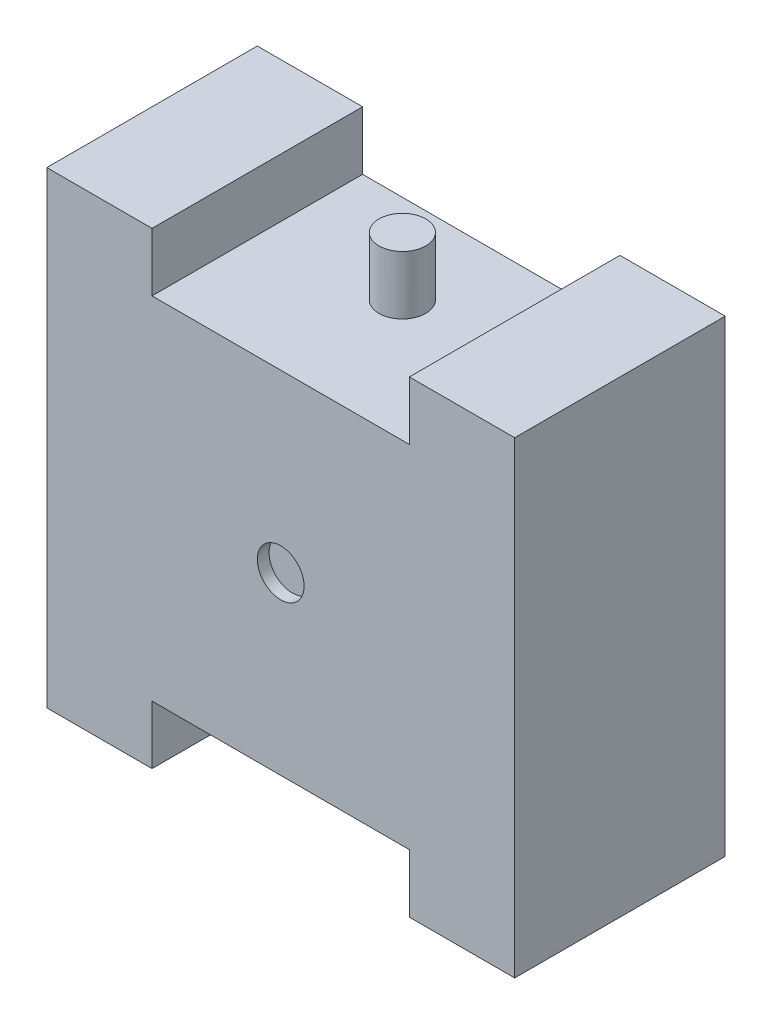
ISO-10303-21;
HEADER;
FILE_DESCRIPTION(('STEP AP214'),'2;1');
FILE_NAME('part.step','',(''),(''),'','','');
FILE_SCHEMA(('AUTOMOTIVE_DESIGN { 1 0 10303 214 1 1 1 1 }'));
ENDSEC;
DATA;
#1=APPLICATION_CONTEXT('core data for automotive mechanical design processes');
#2=APPLICATION_PROTOCOL_DEFINITION('international standard','automotive_design',2000,#1);
#3=PRODUCT_CONTEXT('',#1,'mechanical');
#4=PRODUCT('Part','Part','',(#3));
#5=PRODUCT_RELATED_PRODUCT_CATEGORY('part','',(#4));
#6=PRODUCT_DEFINITION_FORMATION('','',#4);
#7=PRODUCT_DEFINITION_CONTEXT('part definition',#1,'design');
#8=PRODUCT_DEFINITION('design','',#6,#7);
#9=PRODUCT_DEFINITION_SHAPE('','',#8);
#10=(LENGTH_UNIT() NAMED_UNIT(*) SI_UNIT(.MILLI.,.METRE.));
#11=(NAMED_UNIT(*) PLANE_ANGLE_UNIT() SI_UNIT($,.RADIAN.));
#12=(NAMED_UNIT(*) SI_UNIT($,.STERADIAN.) SOLID_ANGLE_UNIT());
#13=UNCERTAINTY_MEASURE_WITH_UNIT(LENGTH_MEASURE(1.E-05),#10,'distance_accuracy_value','');
#14=(GEOMETRIC_REPRESENTATION_CONTEXT(3) GLOBAL_UNCERTAINTY_ASSIGNED_CONTEXT((#13)) GLOBAL_UNIT_ASSIGNED_CONTEXT((#10,
#11,#12)) REPRESENTATION_CONTEXT('',''));
#15=CARTESIAN_POINT('',(0.,0.,0.));
#16=DIRECTION('',(0.,0.,1.));
#17=DIRECTION('',(1.,0.,0.));
#18=AXIS2_PLACEMENT_3D('',#15,#16,#17);
#19=CARTESIAN_POINT('',(275.,500.,450.));
#20=DIRECTION('',(0.,-1.,0.));
#21=DIRECTION('',(0.,0.,-1.));
#22=AXIS2_PLACEMENT_3D('',#19,#20,#21);
#23=PLANE('',#22);
#24=DIRECTION('',(-1.,0.,0.));
#25=VECTOR('',#24,1.);
#26=CARTESIAN_POINT('',(275.,500.,0.));
#27=LINE('',#26,#25);
#28=CARTESIAN_POINT('',(500.,500.,0.));
#29=VERTEX_POINT('',#28);
#30=CARTESIAN_POINT('',(275.,500.,0.));
#31=VERTEX_POINT('',#30);
#32=EDGE_CURVE('E251',#29,#31,#27,.T.);
#33=ORIENTED_EDGE('',*,*,#32,.T.);
#34=DIRECTION('',(0.,0.,-1.));
#35=VECTOR('',#34,1.);
#36=CARTESIAN_POINT('',(275.,500.,450.));
#37=LINE('',#36,#35);
#38=CARTESIAN_POINT('',(275.,500.,450.));
#39=VERTEX_POINT('',#38);
#40=EDGE_CURVE('E334',#39,#31,#37,.T.);
#41=ORIENTED_EDGE('',*,*,#40,.F.);
#42=DIRECTION('',(-1.,0.,0.));
#43=VECTOR('',#42,1.);
#44=CARTESIAN_POINT('',(275.,500.,450.));
#45=LINE('',#44,#43);
#46=CARTESIAN_POINT('',(500.,500.,450.));
#47=VERTEX_POINT('',#46);
#48=EDGE_CURVE('E252',#47,#39,#45,.T.);
#49=ORIENTED_EDGE('',*,*,#48,.F.);
#50=DIRECTION('',(0.,0.,-1.));
#51=VECTOR('',#50,1.);
#52=CARTESIAN_POINT('',(500.,500.,450.));
#53=LINE('',#52,#51);
#54=EDGE_CURVE('E278',#47,#29,#53,.T.);
#55=ORIENTED_EDGE('',*,*,#54,.T.);
#56=EDGE_LOOP('',(#33,#41,#49,#55));
#57=FACE_BOUND('',#56,.T.);
#58=ADVANCED_FACE('F35',(#57),#23,.F.);
#59=CARTESIAN_POINT('',(275.,375.,450.));
#60=DIRECTION('',(1.,0.,0.));
#61=DIRECTION('',(0.,1.,0.));
#62=AXIS2_PLACEMENT_3D('',#59,#60,#61);
#63=PLANE('',#62);
#64=DIRECTION('',(0.,-1.,0.));
#65=VECTOR('',#64,1.);
#66=CARTESIAN_POINT('',(275.,375.,0.));
#67=LINE('',#66,#65);
#68=CARTESIAN_POINT('',(275.,375.,0.));
#69=VERTEX_POINT('',#68);
#70=EDGE_CURVE('E281',#31,#69,#67,.T.);
#71=ORIENTED_EDGE('',*,*,#70,.T.);
#72=DIRECTION('',(0.,0.,-1.));
#73=VECTOR('',#72,1.);
#74=CARTESIAN_POINT('',(275.,375.,450.));
#75=LINE('',#74,#73);
#76=CARTESIAN_POINT('',(275.,375.,450.));
#77=VERTEX_POINT('',#76);
#78=EDGE_CURVE('E331',#77,#69,#75,.T.);
#79=ORIENTED_EDGE('',*,*,#78,.F.);
#80=DIRECTION('',(0.,-1.,0.));
#81=VECTOR('',#80,1.);
#82=CARTESIAN_POINT('',(275.,375.,450.));
#83=LINE('',#82,#81);
#84=EDGE_CURVE('E255',#39,#77,#83,.T.);
#85=ORIENTED_EDGE('',*,*,#84,.F.);
#86=ORIENTED_EDGE('',*,*,#40,.T.);
#87=EDGE_LOOP('',(#71,#79,#85,#86));
#88=FACE_BOUND('',#87,.T.);
#89=ADVANCED_FACE('F402',(#88),#63,.F.);
#90=CARTESIAN_POINT('',(-275.,375.,450.));
#91=DIRECTION('',(0.,-1.,0.));
#92=DIRECTION('',(0.,0.,-1.));
#93=AXIS2_PLACEMENT_3D('',#90,#91,#92);
#94=PLANE('',#93);
#95=CARTESIAN_POINT('',(0.,375.,190.));
#96=DIRECTION('',(0.,-1.,0.));
#97=DIRECTION('',(0.,0.,-1.));
#98=AXIS2_PLACEMENT_3D('',#95,#96,#97);
#99=CIRCLE('',#98,50.);
#100=CARTESIAN_POINT('',(0.,375.,140.));
#101=VERTEX_POINT('',#100);
#102=EDGE_CURVE('E11',#101,#101,#99,.F.);
#103=ORIENTED_EDGE('',*,*,#102,.F.);
#104=EDGE_LOOP('',(#103));
#105=FACE_BOUND('',#104,.T.);
#106=DIRECTION('',(-1.,0.,0.));
#107=VECTOR('',#106,1.);
#108=CARTESIAN_POINT('',(-275.,375.,0.));
#109=LINE('',#108,#107);
#110=CARTESIAN_POINT('',(-275.,375.,0.));
#111=VERTEX_POINT('',#110);
#112=EDGE_CURVE('E283',#69,#111,#109,.T.);
#113=ORIENTED_EDGE('',*,*,#112,.T.);
#114=DIRECTION('',(0.,0.,-1.));
#115=VECTOR('',#114,1.);
#116=CARTESIAN_POINT('',(-275.,375.,450.));
#117=LINE('',#116,#115);
#118=CARTESIAN_POINT('',(-275.,375.,450.));
#119=VERTEX_POINT('',#118);
#120=EDGE_CURVE('E328',#119,#111,#117,.T.);
#121=ORIENTED_EDGE('',*,*,#120,.F.);
#122=DIRECTION('',(-1.,0.,0.));
#123=VECTOR('',#122,1.);
#124=CARTESIAN_POINT('',(-275.,375.,450.));
#125=LINE('',#124,#123);
#126=EDGE_CURVE('E258',#77,#119,#125,.T.);
#127=ORIENTED_EDGE('',*,*,#126,.F.);
#128=ORIENTED_EDGE('',*,*,#78,.T.);
#129=EDGE_LOOP('',(#113,#121,#127,#128));
#130=FACE_BOUND('',#129,.T.);
#131=ADVANCED_FACE('F399',(#105,#130),#94,.F.);
#132=CARTESIAN_POINT('',(-275.,500.,450.));
#133=DIRECTION('',(-1.,0.,0.));
#134=DIRECTION('',(0.,0.,1.));
#135=AXIS2_PLACEMENT_3D('',#132,#133,#134);
#136=PLANE('',#135);
#137=DIRECTION('',(0.,1.,0.));
#138=VECTOR('',#137,1.);
#139=CARTESIAN_POINT('',(-275.,500.,0.));
#140=LINE('',#139,#138);
#141=CARTESIAN_POINT('',(-275.,500.,0.));
#142=VERTEX_POINT('',#141);
#143=EDGE_CURVE('E285',#111,#142,#140,.T.);
#144=ORIENTED_EDGE('',*,*,#143,.T.);
#145=DIRECTION('',(0.,0.,-1.));
#146=VECTOR('',#145,1.);
#147=CARTESIAN_POINT('',(-275.,500.,450.));
#148=LINE('',#147,#146);
#149=CARTESIAN_POINT('',(-275.,500.,450.));
#150=VERTEX_POINT('',#149);
#151=EDGE_CURVE('E325',#150,#142,#148,.T.);
#152=ORIENTED_EDGE('',*,*,#151,.F.);
#153=DIRECTION('',(0.,1.,0.));
#154=VECTOR('',#153,1.);
#155=CARTESIAN_POINT('',(-275.,500.,450.));
#156=LINE('',#155,#154);
#157=EDGE_CURVE('E260',#119,#150,#156,.T.);
#158=ORIENTED_EDGE('',*,*,#157,.F.);
#159=ORIENTED_EDGE('',*,*,#120,.T.);
#160=EDGE_LOOP('',(#144,#152,#158,#159));
#161=FACE_BOUND('',#160,.T.);
#162=ADVANCED_FACE('F394',(#161),#136,.F.);
#163=CARTESIAN_POINT('',(-500.,500.,450.));
#164=DIRECTION('',(0.,-1.,0.));
#165=DIRECTION('',(0.,0.,-1.));
#166=AXIS2_PLACEMENT_3D('',#163,#164,#165);
#167=PLANE('',#166);
#168=DIRECTION('',(-1.,0.,0.));
#169=VECTOR('',#168,1.);
#170=CARTESIAN_POINT('',(-500.,500.,0.));
#171=LINE('',#170,#169);
#172=CARTESIAN_POINT('',(-500.,500.,0.));
#173=VERTEX_POINT('',#172);
#174=EDGE_CURVE('E287',#142,#173,#171,.T.);
#175=ORIENTED_EDGE('',*,*,#174,.T.);
#176=DIRECTION('',(0.,0.,-1.));
#177=VECTOR('',#176,1.);
#178=CARTESIAN_POINT('',(-500.,500.,450.));
#179=LINE('',#178,#177);
#180=CARTESIAN_POINT('',(-500.,500.,450.));
#181=VERTEX_POINT('',#180);
#182=EDGE_CURVE('E322',#181,#173,#179,.T.);
#183=ORIENTED_EDGE('',*,*,#182,.F.);
#184=DIRECTION('',(-1.,0.,0.));
#185=VECTOR('',#184,1.);
#186=CARTESIAN_POINT('',(-500.,500.,450.));
#187=LINE('',#186,#185);
#188=EDGE_CURVE('E262',#150,#181,#187,.T.);
#189=ORIENTED_EDGE('',*,*,#188,.F.);
#190=ORIENTED_EDGE('',*,*,#151,.T.);
#191=EDGE_LOOP('',(#175,#183,#189,#190));
#192=FACE_BOUND('',#191,.T.);
#193=ADVANCED_FACE('F389',(#192),#167,.F.);
#194=CARTESIAN_POINT('',(-500.,-500.,450.));
#195=DIRECTION('',(1.,0.,0.));
#196=DIRECTION('',(0.,0.,-1.));
#197=AXIS2_PLACEMENT_3D('',#194,#195,#196);
#198=PLANE('',#197);
#199=DIRECTION('',(0.,-1.,0.));
#200=VECTOR('',#199,1.);
#201=CARTESIAN_POINT('',(-500.,-500.,0.));
#202=LINE('',#201,#200);
#203=CARTESIAN_POINT('',(-500.,-500.,0.));
#204=VERTEX_POINT('',#203);
#205=EDGE_CURVE('E289',#173,#204,#202,.T.);
#206=ORIENTED_EDGE('',*,*,#205,.T.);
#207=DIRECTION('',(0.,0.,-1.));
#208=VECTOR('',#207,1.);
#209=CARTESIAN_POINT('',(-500.,-500.,450.));
#210=LINE('',#209,#208);
#211=CARTESIAN_POINT('',(-500.,-500.,450.));
#212=VERTEX_POINT('',#211);
#213=EDGE_CURVE('E319',#212,#204,#210,.T.);
#214=ORIENTED_EDGE('',*,*,#213,.F.);
#215=DIRECTION('',(0.,-1.,0.));
#216=VECTOR('',#215,1.);
#217=CARTESIAN_POINT('',(-500.,-500.,450.));
#218=LINE('',#217,#216);
#219=EDGE_CURVE('E264',#181,#212,#218,.T.);
#220=ORIENTED_EDGE('',*,*,#219,.F.);
#221=ORIENTED_EDGE('',*,*,#182,.T.);
#222=EDGE_LOOP('',(#206,#214,#220,#221));
#223=FACE_BOUND('',#222,.T.);
#224=ADVANCED_FACE('F385',(#223),#198,.F.);
#225=CARTESIAN_POINT('',(-500.,-500.,450.));
#226=DIRECTION('',(0.,1.,0.));
#227=DIRECTION('',(0.,0.,1.));
#228=AXIS2_PLACEMENT_3D('',#225,#226,#227);
#229=PLANE('',#228);
#230=DIRECTION('',(1.,0.,0.));
#231=VECTOR('',#230,1.);
#232=CARTESIAN_POINT('',(-500.,-500.,0.));
#233=LINE('',#232,#231);
#234=CARTESIAN_POINT('',(-275.,-500.,0.));
#235=VERTEX_POINT('',#234);
#236=EDGE_CURVE('E291',#204,#235,#233,.T.);
#237=ORIENTED_EDGE('',*,*,#236,.T.);
#238=DIRECTION('',(0.,0.,-1.));
#239=VECTOR('',#238,1.);
#240=CARTESIAN_POINT('',(-275.,-500.,450.));
#241=LINE('',#240,#239);
#242=CARTESIAN_POINT('',(-275.,-500.,450.));
#243=VERTEX_POINT('',#242);
#244=EDGE_CURVE('E316',#243,#235,#241,.T.);
#245=ORIENTED_EDGE('',*,*,#244,.F.);
#246=DIRECTION('',(1.,0.,0.));
#247=VECTOR('',#246,1.);
#248=CARTESIAN_POINT('',(-500.,-500.,450.));
#249=LINE('',#248,#247);
#250=EDGE_CURVE('E266',#212,#243,#249,.T.);
#251=ORIENTED_EDGE('',*,*,#250,.F.);
#252=ORIENTED_EDGE('',*,*,#213,.T.);
#253=EDGE_LOOP('',(#237,#245,#251,#252));
#254=FACE_BOUND('',#253,.T.);
#255=ADVANCED_FACE('F381',(#254),#229,.F.);
#256=CARTESIAN_POINT('',(-275.,-500.,450.));
#257=DIRECTION('',(-1.,0.,0.));
#258=DIRECTION('',(0.,0.,1.));
#259=AXIS2_PLACEMENT_3D('',#256,#257,#258);
#260=PLANE('',#259);
#261=DIRECTION('',(0.,1.,0.));
#262=VECTOR('',#261,1.);
#263=CARTESIAN_POINT('',(-275.,-500.,0.));
#264=LINE('',#263,#262);
#265=CARTESIAN_POINT('',(-275.,-375.,0.));
#266=VERTEX_POINT('',#265);
#267=EDGE_CURVE('E293',#235,#266,#264,.T.);
#268=ORIENTED_EDGE('',*,*,#267,.T.);
#269=DIRECTION('',(0.,0.,-1.));
#270=VECTOR('',#269,1.);
#271=CARTESIAN_POINT('',(-275.,-375.,450.));
#272=LINE('',#271,#270);
#273=CARTESIAN_POINT('',(-275.,-375.,450.));
#274=VERTEX_POINT('',#273);
#275=EDGE_CURVE('E313',#274,#266,#272,.T.);
#276=ORIENTED_EDGE('',*,*,#275,.F.);
#277=DIRECTION('',(0.,1.,0.));
#278=VECTOR('',#277,1.);
#279=CARTESIAN_POINT('',(-275.,-500.,450.));
#280=LINE('',#279,#278);
#281=EDGE_CURVE('E268',#243,#274,#280,.T.);
#282=ORIENTED_EDGE('',*,*,#281,.F.);
#283=ORIENTED_EDGE('',*,*,#244,.T.);
#284=EDGE_LOOP('',(#268,#276,#282,#283));
#285=FACE_BOUND('',#284,.T.);
#286=ADVANCED_FACE('F345',(#285),#260,.F.);
#287=CARTESIAN_POINT('',(-275.,-375.,450.));
#288=DIRECTION('',(0.,1.,0.));
#289=DIRECTION('',(0.,0.,1.));
#290=AXIS2_PLACEMENT_3D('',#287,#288,#289);
#291=PLANE('',#290);
#292=CARTESIAN_POINT('',(0.,-375.,190.));
#293=DIRECTION('',(0.,1.,0.));
#294=DIRECTION('',(0.,0.,1.));
#295=AXIS2_PLACEMENT_3D('',#292,#293,#294);
#296=CIRCLE('',#295,50.);
#297=CARTESIAN_POINT('',(0.,-375.,240.));
#298=VERTEX_POINT('',#297);
#299=EDGE_CURVE('E42',#298,#298,#296,.F.);
#300=ORIENTED_EDGE('',*,*,#299,.F.);
#301=EDGE_LOOP('',(#300));
#302=FACE_BOUND('',#301,.T.);
#303=DIRECTION('',(1.,0.,0.));
#304=VECTOR('',#303,1.);
#305=CARTESIAN_POINT('',(-275.,-375.,0.));
#306=LINE('',#305,#304);
#307=CARTESIAN_POINT('',(275.,-375.,0.));
#308=VERTEX_POINT('',#307);
#309=EDGE_CURVE('E295',#266,#308,#306,.T.);
#310=ORIENTED_EDGE('',*,*,#309,.T.);
#311=DIRECTION('',(0.,0.,-1.));
#312=VECTOR('',#311,1.);
#313=CARTESIAN_POINT('',(275.,-375.,450.));
#314=LINE('',#313,#312);
#315=CARTESIAN_POINT('',(275.,-375.,450.));
#316=VERTEX_POINT('',#315);
#317=EDGE_CURVE('E310',#316,#308,#314,.T.);
#318=ORIENTED_EDGE('',*,*,#317,.F.);
#319=DIRECTION('',(1.,0.,0.));
#320=VECTOR('',#319,1.);
#321=CARTESIAN_POINT('',(-275.,-375.,450.));
#322=LINE('',#321,#320);
#323=EDGE_CURVE('E270',#274,#316,#322,.T.);
#324=ORIENTED_EDGE('',*,*,#323,.F.);
#325=ORIENTED_EDGE('',*,*,#275,.T.);
#326=EDGE_LOOP('',(#310,#318,#324,#325));
#327=FACE_BOUND('',#326,.T.);
#328=ADVANCED_FACE('F341',(#302,#327),#291,.F.);
#329=CARTESIAN_POINT('',(275.,-375.,450.));
#330=DIRECTION('',(1.,0.,0.));
#331=DIRECTION('',(0.,1.,0.));
#332=AXIS2_PLACEMENT_3D('',#329,#330,#331);
#333=PLANE('',#332);
#334=DIRECTION('',(0.,-1.,0.));
#335=VECTOR('',#334,1.);
#336=CARTESIAN_POINT('',(275.,-375.,0.));
#337=LINE('',#336,#335);
#338=CARTESIAN_POINT('',(275.,-500.,0.));
#339=VERTEX_POINT('',#338);
#340=EDGE_CURVE('E297',#308,#339,#337,.T.);
#341=ORIENTED_EDGE('',*,*,#340,.T.);
#342=DIRECTION('',(0.,0.,-1.));
#343=VECTOR('',#342,1.);
#344=CARTESIAN_POINT('',(275.,-500.,450.));
#345=LINE('',#344,#343);
#346=CARTESIAN_POINT('',(275.,-500.,450.));
#347=VERTEX_POINT('',#346);
#348=EDGE_CURVE('E307',#347,#339,#345,.T.);
#349=ORIENTED_EDGE('',*,*,#348,.F.);
#350=DIRECTION('',(0.,-1.,0.));
#351=VECTOR('',#350,1.);
#352=CARTESIAN_POINT('',(275.,-375.,450.));
#353=LINE('',#352,#351);
#354=EDGE_CURVE('E272',#316,#347,#353,.T.);
#355=ORIENTED_EDGE('',*,*,#354,.F.);
#356=ORIENTED_EDGE('',*,*,#317,.T.);
#357=EDGE_LOOP('',(#341,#349,#355,#356));
#358=FACE_BOUND('',#357,.T.);
#359=ADVANCED_FACE('F344',(#358),#333,.F.);
#360=CARTESIAN_POINT('',(275.,-500.,450.));
#361=DIRECTION('',(0.,1.,0.));
#362=DIRECTION('',(0.,0.,1.));
#363=AXIS2_PLACEMENT_3D('',#360,#361,#362);
#364=PLANE('',#363);
#365=DIRECTION('',(1.,0.,0.));
#366=VECTOR('',#365,1.);
#367=CARTESIAN_POINT('',(275.,-500.,0.));
#368=LINE('',#367,#366);
#369=CARTESIAN_POINT('',(500.,-500.,0.));
#370=VERTEX_POINT('',#369);
#371=EDGE_CURVE('E299',#339,#370,#368,.T.);
#372=ORIENTED_EDGE('',*,*,#371,.T.);
#373=DIRECTION('',(0.,0.,-1.));
#374=VECTOR('',#373,1.);
#375=CARTESIAN_POINT('',(500.,-500.,450.));
#376=LINE('',#375,#374);
#377=CARTESIAN_POINT('',(500.,-500.,450.));
#378=VERTEX_POINT('',#377);
#379=EDGE_CURVE('E304',#378,#370,#376,.T.);
#380=ORIENTED_EDGE('',*,*,#379,.F.);
#381=DIRECTION('',(1.,0.,0.));
#382=VECTOR('',#381,1.);
#383=CARTESIAN_POINT('',(275.,-500.,450.));
#384=LINE('',#383,#382);
#385=EDGE_CURVE('E274',#347,#378,#384,.T.);
#386=ORIENTED_EDGE('',*,*,#385,.F.);
#387=ORIENTED_EDGE('',*,*,#348,.T.);
#388=EDGE_LOOP('',(#372,#380,#386,#387));
#389=FACE_BOUND('',#388,.T.);
#390=ADVANCED_FACE('F363',(#389),#364,.F.);
#391=CARTESIAN_POINT('',(500.,-500.,450.));
#392=DIRECTION('',(-1.,0.,0.));
#393=DIRECTION('',(0.,0.,1.));
#394=AXIS2_PLACEMENT_3D('',#391,#392,#393);
#395=PLANE('',#394);
#396=DIRECTION('',(0.,1.,0.));
#397=VECTOR('',#396,1.);
#398=CARTESIAN_POINT('',(500.,-500.,0.));
#399=LINE('',#398,#397);
#400=EDGE_CURVE('E256',#370,#29,#399,.T.);
#401=ORIENTED_EDGE('',*,*,#400,.T.);
#402=ORIENTED_EDGE('',*,*,#54,.F.);
#403=DIRECTION('',(0.,1.,0.));
#404=VECTOR('',#403,1.);
#405=CARTESIAN_POINT('',(500.,-500.,450.));
#406=LINE('',#405,#404);
#407=EDGE_CURVE('E276',#378,#47,#406,.T.);
#408=ORIENTED_EDGE('',*,*,#407,.F.);
#409=ORIENTED_EDGE('',*,*,#379,.T.);
#410=EDGE_LOOP('',(#401,#402,#408,#409));
#411=FACE_BOUND('',#410,.T.);
#412=ADVANCED_FACE('F367',(#411),#395,.F.);
#413=CARTESIAN_POINT('',(0.,0.,450.));
#414=DIRECTION('',(0.,0.,1.));
#415=DIRECTION('',(1.,0.,0.));
#416=AXIS2_PLACEMENT_3D('',#413,#414,#415);
#417=PLANE('',#416);
#418=CARTESIAN_POINT('',(0.,0.,450.));
#419=DIRECTION('',(0.,0.,1.));
#420=DIRECTION('',(1.,0.,0.));
#421=AXIS2_PLACEMENT_3D('',#418,#419,#420);
#422=CIRCLE('',#421,50.);
#423=CARTESIAN_POINT('',(50.,0.,450.));
#424=VERTEX_POINT('',#423);
#425=EDGE_CURVE('E207',#424,#424,#422,.T.);
#426=ORIENTED_EDGE('',*,*,#425,.F.);
#427=EDGE_LOOP('',(#426));
#428=FACE_BOUND('',#427,.T.);
#429=ORIENTED_EDGE('',*,*,#48,.T.);
#430=ORIENTED_EDGE('',*,*,#84,.T.);
#431=ORIENTED_EDGE('',*,*,#126,.T.);
#432=ORIENTED_EDGE('',*,*,#157,.T.);
#433=ORIENTED_EDGE('',*,*,#188,.T.);
#434=ORIENTED_EDGE('',*,*,#219,.T.);
#435=ORIENTED_EDGE('',*,*,#250,.T.);
#436=ORIENTED_EDGE('',*,*,#281,.T.);
#437=ORIENTED_EDGE('',*,*,#323,.T.);
#438=ORIENTED_EDGE('',*,*,#354,.T.);
#439=ORIENTED_EDGE('',*,*,#385,.T.);
#440=ORIENTED_EDGE('',*,*,#407,.T.);
#441=EDGE_LOOP('',(#429,#430,#431,#432,#433,#434,#435,#436,#437,#438,#439,#440));
#442=FACE_BOUND('',#441,.T.);
#443=ADVANCED_FACE('F371',(#428,#442),#417,.T.);
#444=CARTESIAN_POINT('',(0.,0.,0.));
#445=DIRECTION('',(0.,0.,1.));
#446=DIRECTION('',(1.,0.,0.));
#447=AXIS2_PLACEMENT_3D('',#444,#445,#446);
#448=PLANE('',#447);
#449=DIRECTION('',(1.,0.,0.));
#450=VECTOR('',#449,1.);
#451=CARTESIAN_POINT('',(-300.,50.,0.));
#452=LINE('',#451,#450);
#453=CARTESIAN_POINT('',(-400.,50.,0.));
#454=VERTEX_POINT('',#453);
#455=CARTESIAN_POINT('',(-300.,50.,0.));
#456=VERTEX_POINT('',#455);
#457=EDGE_CURVE('E200',#454,#456,#452,.T.);
#458=ORIENTED_EDGE('',*,*,#457,.F.);
#459=DIRECTION('',(0.,1.,0.));
#460=VECTOR('',#459,1.);
#461=CARTESIAN_POINT('',(-400.,-50.,0.));
#462=LINE('',#461,#460);
#463=CARTESIAN_POINT('',(-400.,-50.,0.));
#464=VERTEX_POINT('',#463);
#465=EDGE_CURVE('E49',#464,#454,#462,.T.);
#466=ORIENTED_EDGE('',*,*,#465,.F.);
#467=DIRECTION('',(-1.,0.,0.));
#468=VECTOR('',#467,1.);
#469=CARTESIAN_POINT('',(-300.,-50.,0.));
#470=LINE('',#469,#468);
#471=CARTESIAN_POINT('',(-300.,-50.,0.));
#472=VERTEX_POINT('',#471);
#473=EDGE_CURVE('E191',#472,#464,#470,.T.);
#474=ORIENTED_EDGE('',*,*,#473,.F.);
#475=DIRECTION('',(0.,-1.,0.));
#476=VECTOR('',#475,1.);
#477=CARTESIAN_POINT('',(-300.,-50.,0.));
#478=LINE('',#477,#476);
#479=EDGE_CURVE('E194',#456,#472,#478,.T.);
#480=ORIENTED_EDGE('',*,*,#479,.F.);
#481=EDGE_LOOP('',(#458,#466,#474,#480));
#482=FACE_BOUND('',#481,.T.);
#483=DIRECTION('',(1.,0.,0.));
#484=VECTOR('',#483,1.);
#485=CARTESIAN_POINT('',(300.,50.,0.));
#486=LINE('',#485,#484);
#487=CARTESIAN_POINT('',(300.,50.,0.));
#488=VERTEX_POINT('',#487);
#489=CARTESIAN_POINT('',(400.,49.9999999999999,0.));
#490=VERTEX_POINT('',#489);
#491=EDGE_CURVE('E226',#488,#490,#486,.T.);
#492=ORIENTED_EDGE('',*,*,#491,.F.);
#493=DIRECTION('',(0.,1.,0.));
#494=VECTOR('',#493,1.);
#495=CARTESIAN_POINT('',(300.,-50.,0.));
#496=LINE('',#495,#494);
#497=CARTESIAN_POINT('',(300.,-50.,0.));
#498=VERTEX_POINT('',#497);
#499=EDGE_CURVE('E57',#498,#488,#496,.T.);
#500=ORIENTED_EDGE('',*,*,#499,.F.);
#501=DIRECTION('',(-1.,0.,0.));
#502=VECTOR('',#501,1.);
#503=CARTESIAN_POINT('',(300.,-50.,0.));
#504=LINE('',#503,#502);
#505=CARTESIAN_POINT('',(400.,-50.0000000000001,0.));
#506=VERTEX_POINT('',#505);
#507=EDGE_CURVE('E215',#506,#498,#504,.T.);
#508=ORIENTED_EDGE('',*,*,#507,.F.);
#509=DIRECTION('',(0.,-1.,0.));
#510=VECTOR('',#509,1.);
#511=CARTESIAN_POINT('',(400.,-50.0000000000001,0.));
#512=LINE('',#511,#510);
#513=EDGE_CURVE('E229',#490,#506,#512,.T.);
#514=ORIENTED_EDGE('',*,*,#513,.F.);
#515=EDGE_LOOP('',(#492,#500,#508,#514));
#516=FACE_BOUND('',#515,.T.);
#517=ORIENTED_EDGE('',*,*,#32,.F.);
#518=ORIENTED_EDGE('',*,*,#400,.F.);
#519=ORIENTED_EDGE('',*,*,#371,.F.);
#520=ORIENTED_EDGE('',*,*,#340,.F.);
#521=ORIENTED_EDGE('',*,*,#309,.F.);
#522=ORIENTED_EDGE('',*,*,#267,.F.);
#523=ORIENTED_EDGE('',*,*,#236,.F.);
#524=ORIENTED_EDGE('',*,*,#205,.F.);
#525=ORIENTED_EDGE('',*,*,#174,.F.);
#526=ORIENTED_EDGE('',*,*,#143,.F.);
#527=ORIENTED_EDGE('',*,*,#112,.F.);
#528=ORIENTED_EDGE('',*,*,#70,.F.);
#529=EDGE_LOOP('',(#517,#518,#519,#520,#521,#522,#523,#524,#525,#526,#527,#528));
#530=FACE_BOUND('',#529,.T.);
#531=ADVANCED_FACE('F359',(#482,#516,#530),#448,.F.);
#532=CARTESIAN_POINT('',(0.,-500.,190.));
#533=DIRECTION('',(0.,1.,0.));
#534=DIRECTION('',(0.,0.,1.));
#535=AXIS2_PLACEMENT_3D('',#532,#533,#534);
#536=CYLINDRICAL_SURFACE('',#535,50.);
#537=CARTESIAN_POINT('',(0.,-500.,190.));
#538=DIRECTION('',(0.,-1.,0.));
#539=DIRECTION('',(0.,0.,-1.));
#540=AXIS2_PLACEMENT_3D('',#537,#538,#539);
#541=CIRCLE('',#540,50.);
#542=CARTESIAN_POINT('',(0.,-500.,140.));
#543=VERTEX_POINT('',#542);
#544=EDGE_CURVE('E248',#543,#543,#541,.T.);
#545=ORIENTED_EDGE('',*,*,#544,.F.);
#546=EDGE_LOOP('',(#545));
#547=FACE_BOUND('',#546,.T.);
#548=ORIENTED_EDGE('',*,*,#299,.T.);
#549=EDGE_LOOP('',(#548));
#550=FACE_BOUND('',#549,.T.);
#551=ADVANCED_FACE('F339',(#547,#550),#536,.T.);
#552=CARTESIAN_POINT('',(0.,-500.,190.));
#553=DIRECTION('',(0.,-1.,0.));
#554=DIRECTION('',(0.,0.,-1.));
#555=AXIS2_PLACEMENT_3D('',#552,#553,#554);
#556=PLANE('',#555);
#557=ORIENTED_EDGE('',*,*,#544,.T.);
#558=EDGE_LOOP('',(#557));
#559=FACE_BOUND('',#558,.T.);
#560=ADVANCED_FACE('F438',(#559),#556,.T.);
#561=CARTESIAN_POINT('',(0.,500.,190.));
#562=DIRECTION('',(0.,-1.,0.));
#563=DIRECTION('',(0.,0.,-1.));
#564=AXIS2_PLACEMENT_3D('',#561,#562,#563);
#565=CYLINDRICAL_SURFACE('',#564,50.);
#566=CARTESIAN_POINT('',(0.,500.,190.));
#567=DIRECTION('',(0.,1.,0.));
#568=DIRECTION('',(0.,0.,1.));
#569=AXIS2_PLACEMENT_3D('',#566,#567,#568);
#570=CIRCLE('',#569,50.);
#571=CARTESIAN_POINT('',(0.,500.,240.));
#572=VERTEX_POINT('',#571);
#573=EDGE_CURVE('E243',#572,#572,#570,.T.);
#574=ORIENTED_EDGE('',*,*,#573,.F.);
#575=EDGE_LOOP('',(#574));
#576=FACE_BOUND('',#575,.T.);
#577=ORIENTED_EDGE('',*,*,#102,.T.);
#578=EDGE_LOOP('',(#577));
#579=FACE_BOUND('',#578,.T.);
#580=ADVANCED_FACE('F442',(#576,#579),#565,.T.);
#581=CARTESIAN_POINT('',(0.,500.,190.));
#582=DIRECTION('',(0.,1.,0.));
#583=DIRECTION('',(0.,0.,1.));
#584=AXIS2_PLACEMENT_3D('',#581,#582,#583);
#585=PLANE('',#584);
#586=ORIENTED_EDGE('',*,*,#573,.T.);
#587=EDGE_LOOP('',(#586));
#588=FACE_BOUND('',#587,.T.);
#589=ADVANCED_FACE('F446',(#588),#585,.T.);
#590=CARTESIAN_POINT('',(0.,0.,425.));
#591=DIRECTION('',(0.,0.,1.));
#592=DIRECTION('',(1.,0.,0.));
#593=AXIS2_PLACEMENT_3D('',#590,#591,#592);
#594=CYLINDRICAL_SURFACE('',#593,50.);
#595=CARTESIAN_POINT('',(0.,0.,425.));
#596=DIRECTION('',(0.,0.,1.));
#597=DIRECTION('',(1.,0.,0.));
#598=AXIS2_PLACEMENT_3D('',#595,#596,#597);
#599=CIRCLE('',#598,50.);
#600=CARTESIAN_POINT('',(50.,0.,425.));
#601=VERTEX_POINT('',#600);
#602=EDGE_CURVE('E240',#601,#601,#599,.T.);
#603=ORIENTED_EDGE('',*,*,#602,.F.);
#604=EDGE_LOOP('',(#603));
#605=FACE_BOUND('',#604,.T.);
#606=ORIENTED_EDGE('',*,*,#425,.T.);
#607=EDGE_LOOP('',(#606));
#608=FACE_BOUND('',#607,.T.);
#609=ADVANCED_FACE('F450',(#605,#608),#594,.F.);
#610=CARTESIAN_POINT('',(0.,0.,425.));
#611=DIRECTION('',(0.,0.,1.));
#612=DIRECTION('',(1.,0.,0.));
#613=AXIS2_PLACEMENT_3D('',#610,#611,#612);
#614=PLANE('',#613);
#615=ORIENTED_EDGE('',*,*,#602,.T.);
#616=EDGE_LOOP('',(#615));
#617=FACE_BOUND('',#616,.T.);
#618=ADVANCED_FACE('F454',(#617),#614,.T.);
#619=CARTESIAN_POINT('',(300.,-50.,25.));
#620=DIRECTION('',(-1.,0.,0.));
#621=DIRECTION('',(0.,0.,1.));
#622=AXIS2_PLACEMENT_3D('',#619,#620,#621);
#623=PLANE('',#622);
#624=ORIENTED_EDGE('',*,*,#499,.T.);
#625=DIRECTION('',(0.,0.,-1.));
#626=VECTOR('',#625,1.);
#627=CARTESIAN_POINT('',(300.,50.,25.));
#628=LINE('',#627,#626);
#629=CARTESIAN_POINT('',(300.,50.,25.));
#630=VERTEX_POINT('',#629);
#631=EDGE_CURVE('E224',#630,#488,#628,.T.);
#632=ORIENTED_EDGE('',*,*,#631,.F.);
#633=DIRECTION('',(0.,1.,0.));
#634=VECTOR('',#633,1.);
#635=CARTESIAN_POINT('',(300.,-50.,25.));
#636=LINE('',#635,#634);
#637=CARTESIAN_POINT('',(300.,-50.,25.));
#638=VERTEX_POINT('',#637);
#639=EDGE_CURVE('E211',#638,#630,#636,.T.);
#640=ORIENTED_EDGE('',*,*,#639,.F.);
#641=DIRECTION('',(0.,0.,-1.));
#642=VECTOR('',#641,1.);
#643=CARTESIAN_POINT('',(300.,-50.,25.));
#644=LINE('',#643,#642);
#645=EDGE_CURVE('E201',#638,#498,#644,.T.);
#646=ORIENTED_EDGE('',*,*,#645,.T.);
#647=EDGE_LOOP('',(#624,#632,#640,#646));
#648=FACE_BOUND('',#647,.T.);
#649=ADVANCED_FACE('F458',(#648),#623,.F.);
#650=CARTESIAN_POINT('',(300.,-50.,25.));
#651=DIRECTION('',(0.,-1.,0.));
#652=DIRECTION('',(1.,0.,0.));
#653=AXIS2_PLACEMENT_3D('',#650,#651,#652);
#654=PLANE('',#653);
#655=ORIENTED_EDGE('',*,*,#507,.T.);
#656=ORIENTED_EDGE('',*,*,#645,.F.);
#657=DIRECTION('',(-1.,0.,0.));
#658=VECTOR('',#657,1.);
#659=CARTESIAN_POINT('',(300.,-50.,25.));
#660=LINE('',#659,#658);
#661=CARTESIAN_POINT('',(400.,-50.0000000000001,25.));
#662=VERTEX_POINT('',#661);
#663=EDGE_CURVE('E221',#662,#638,#660,.T.);
#664=ORIENTED_EDGE('',*,*,#663,.F.);
#665=DIRECTION('',(0.,0.,-1.));
#666=VECTOR('',#665,1.);
#667=CARTESIAN_POINT('',(400.,-50.0000000000001,25.));
#668=LINE('',#667,#666);
#669=EDGE_CURVE('E235',#662,#506,#668,.T.);
#670=ORIENTED_EDGE('',*,*,#669,.T.);
#671=EDGE_LOOP('',(#655,#656,#664,#670));
#672=FACE_BOUND('',#671,.T.);
#673=ADVANCED_FACE('F462',(#672),#654,.F.);
#674=CARTESIAN_POINT('',(400.,-50.0000000000001,25.));
#675=DIRECTION('',(1.,0.,0.));
#676=DIRECTION('',(0.,0.,-1.));
#677=AXIS2_PLACEMENT_3D('',#674,#675,#676);
#678=PLANE('',#677);
#679=ORIENTED_EDGE('',*,*,#513,.T.);
#680=ORIENTED_EDGE('',*,*,#669,.F.);
#681=DIRECTION('',(0.,-1.,0.));
#682=VECTOR('',#681,1.);
#683=CARTESIAN_POINT('',(400.,-50.0000000000001,25.));
#684=LINE('',#683,#682);
#685=CARTESIAN_POINT('',(400.,49.9999999999999,25.));
#686=VERTEX_POINT('',#685);
#687=EDGE_CURVE('E218',#686,#662,#684,.T.);
#688=ORIENTED_EDGE('',*,*,#687,.F.);
#689=DIRECTION('',(0.,0.,-1.));
#690=VECTOR('',#689,1.);
#691=CARTESIAN_POINT('',(400.,49.9999999999999,25.));
#692=LINE('',#691,#690);
#693=EDGE_CURVE('E237',#686,#490,#692,.T.);
#694=ORIENTED_EDGE('',*,*,#693,.T.);
#695=EDGE_LOOP('',(#679,#680,#688,#694));
#696=FACE_BOUND('',#695,.T.);
#697=ADVANCED_FACE('F467',(#696),#678,.F.);
#698=CARTESIAN_POINT('',(300.,50.,25.));
#699=DIRECTION('',(0.,1.,0.));
#700=DIRECTION('',(-1.,0.,0.));
#701=AXIS2_PLACEMENT_3D('',#698,#699,#700);
#702=PLANE('',#701);
#703=ORIENTED_EDGE('',*,*,#491,.T.);
#704=ORIENTED_EDGE('',*,*,#693,.F.);
#705=DIRECTION('',(1.,0.,0.));
#706=VECTOR('',#705,1.);
#707=CARTESIAN_POINT('',(300.,50.,25.));
#708=LINE('',#707,#706);
#709=EDGE_CURVE('E214',#630,#686,#708,.T.);
#710=ORIENTED_EDGE('',*,*,#709,.F.);
#711=ORIENTED_EDGE('',*,*,#631,.T.);
#712=EDGE_LOOP('',(#703,#704,#710,#711));
#713=FACE_BOUND('',#712,.T.);
#714=ADVANCED_FACE('F463',(#713),#702,.F.);
#715=CARTESIAN_POINT('',(0.,0.,25.));
#716=DIRECTION('',(0.,0.,-1.));
#717=DIRECTION('',(-1.,0.,0.));
#718=AXIS2_PLACEMENT_3D('',#715,#716,#717);
#719=PLANE('',#718);
#720=ORIENTED_EDGE('',*,*,#639,.T.);
#721=ORIENTED_EDGE('',*,*,#709,.T.);
#722=ORIENTED_EDGE('',*,*,#687,.T.);
#723=ORIENTED_EDGE('',*,*,#663,.T.);
#724=EDGE_LOOP('',(#720,#721,#722,#723));
#725=FACE_BOUND('',#724,.T.);
#726=ADVANCED_FACE('F466',(#725),#719,.T.);
#727=CARTESIAN_POINT('',(-400.,-50.,25.));
#728=DIRECTION('',(-1.,0.,0.));
#729=DIRECTION('',(0.,0.,1.));
#730=AXIS2_PLACEMENT_3D('',#727,#728,#729);
#731=PLANE('',#730);
#732=ORIENTED_EDGE('',*,*,#465,.T.);
#733=DIRECTION('',(0.,0.,-1.));
#734=VECTOR('',#733,1.);
#735=CARTESIAN_POINT('',(-400.,50.,25.));
#736=LINE('',#735,#734);
#737=CARTESIAN_POINT('',(-400.,50.,25.));
#738=VERTEX_POINT('',#737);
#739=EDGE_CURVE('E169',#738,#454,#736,.T.);
#740=ORIENTED_EDGE('',*,*,#739,.F.);
#741=DIRECTION('',(0.,1.,0.));
#742=VECTOR('',#741,1.);
#743=CARTESIAN_POINT('',(-400.,-50.,25.));
#744=LINE('',#743,#742);
#745=CARTESIAN_POINT('',(-400.,-50.,25.));
#746=VERTEX_POINT('',#745);
#747=EDGE_CURVE('E173',#746,#738,#744,.T.);
#748=ORIENTED_EDGE('',*,*,#747,.F.);
#749=DIRECTION('',(0.,0.,-1.));
#750=VECTOR('',#749,1.);
#751=CARTESIAN_POINT('',(-400.,-50.,25.));
#752=LINE('',#751,#750);
#753=EDGE_CURVE('E205',#746,#464,#752,.T.);
#754=ORIENTED_EDGE('',*,*,#753,.T.);
#755=EDGE_LOOP('',(#732,#740,#748,#754));
#756=FACE_BOUND('',#755,.T.);
#757=ADVANCED_FACE('F171',(#756),#731,.F.);
#758=CARTESIAN_POINT('',(-300.,-50.,25.));
#759=DIRECTION('',(0.,-1.,0.));
#760=DIRECTION('',(0.,0.,-1.));
#761=AXIS2_PLACEMENT_3D('',#758,#759,#760);
#762=PLANE('',#761);
#763=ORIENTED_EDGE('',*,*,#473,.T.);
#764=ORIENTED_EDGE('',*,*,#753,.F.);
#765=DIRECTION('',(-1.,0.,0.));
#766=VECTOR('',#765,1.);
#767=CARTESIAN_POINT('',(-300.,-50.,25.));
#768=LINE('',#767,#766);
#769=CARTESIAN_POINT('',(-300.,-50.,25.));
#770=VERTEX_POINT('',#769);
#771=EDGE_CURVE('E179',#770,#746,#768,.T.);
#772=ORIENTED_EDGE('',*,*,#771,.F.);
#773=DIRECTION('',(0.,0.,-1.));
#774=VECTOR('',#773,1.);
#775=CARTESIAN_POINT('',(-300.,-50.,25.));
#776=LINE('',#775,#774);
#777=EDGE_CURVE('E208',#770,#472,#776,.T.);
#778=ORIENTED_EDGE('',*,*,#777,.T.);
#779=EDGE_LOOP('',(#763,#764,#772,#778));
#780=FACE_BOUND('',#779,.T.);
#781=ADVANCED_FACE('F480',(#780),#762,.F.);
#782=CARTESIAN_POINT('',(-300.,-50.,25.));
#783=DIRECTION('',(1.,0.,0.));
#784=DIRECTION('',(0.,0.,-1.));
#785=AXIS2_PLACEMENT_3D('',#782,#783,#784);
#786=PLANE('',#785);
#787=ORIENTED_EDGE('',*,*,#479,.T.);
#788=ORIENTED_EDGE('',*,*,#777,.F.);
#789=DIRECTION('',(0.,-1.,0.));
#790=VECTOR('',#789,1.);
#791=CARTESIAN_POINT('',(-300.,-50.,25.));
#792=LINE('',#791,#790);
#793=CARTESIAN_POINT('',(-300.,50.,25.));
#794=VERTEX_POINT('',#793);
#795=EDGE_CURVE('E187',#794,#770,#792,.T.);
#796=ORIENTED_EDGE('',*,*,#795,.F.);
#797=DIRECTION('',(0.,0.,-1.));
#798=VECTOR('',#797,1.);
#799=CARTESIAN_POINT('',(-300.,50.,25.));
#800=LINE('',#799,#798);
#801=EDGE_CURVE('E178',#794,#456,#800,.T.);
#802=ORIENTED_EDGE('',*,*,#801,.T.);
#803=EDGE_LOOP('',(#787,#788,#796,#802));
#804=FACE_BOUND('',#803,.T.);
#805=ADVANCED_FACE('F483',(#804),#786,.F.);
#806=CARTESIAN_POINT('',(-300.,50.,25.));
#807=DIRECTION('',(0.,1.,0.));
#808=DIRECTION('',(0.,0.,1.));
#809=AXIS2_PLACEMENT_3D('',#806,#807,#808);
#810=PLANE('',#809);
#811=ORIENTED_EDGE('',*,*,#457,.T.);
#812=ORIENTED_EDGE('',*,*,#801,.F.);
#813=DIRECTION('',(1.,0.,0.));
#814=VECTOR('',#813,1.);
#815=CARTESIAN_POINT('',(-300.,50.,25.));
#816=LINE('',#815,#814);
#817=EDGE_CURVE('E182',#738,#794,#816,.T.);
#818=ORIENTED_EDGE('',*,*,#817,.F.);
#819=ORIENTED_EDGE('',*,*,#739,.T.);
#820=EDGE_LOOP('',(#811,#812,#818,#819));
#821=FACE_BOUND('',#820,.T.);
#822=ADVANCED_FACE('F183',(#821),#810,.F.);
#823=CARTESIAN_POINT('',(0.,0.,25.));
#824=DIRECTION('',(0.,0.,1.));
#825=DIRECTION('',(1.,0.,0.));
#826=AXIS2_PLACEMENT_3D('',#823,#824,#825);
#827=PLANE('',#826);
#828=ORIENTED_EDGE('',*,*,#747,.T.);
#829=ORIENTED_EDGE('',*,*,#817,.T.);
#830=ORIENTED_EDGE('',*,*,#795,.T.);
#831=ORIENTED_EDGE('',*,*,#771,.T.);
#832=EDGE_LOOP('',(#828,#829,#830,#831));
#833=FACE_BOUND('',#832,.T.);
#834=ADVANCED_FACE('F189',(#833),#827,.F.);
#835=CLOSED_SHELL('',(#58,#89,#131,#162,#193,#224,#255,#286,#328,#359,#390,#412,#443,#531,#551,
#560,#580,#589,#609,#618,#649,#673,#697,#714,#726,#757,#781,#805,#822,#834));
#836=MANIFOLD_SOLID_BREP('B2',#835);
#837=ADVANCED_BREP_SHAPE_REPRESENTATION('',(#18,#836),#14);
#838=SHAPE_DEFINITION_REPRESENTATION(#9,#837);
ENDSEC;
END-ISO-10303-21;
